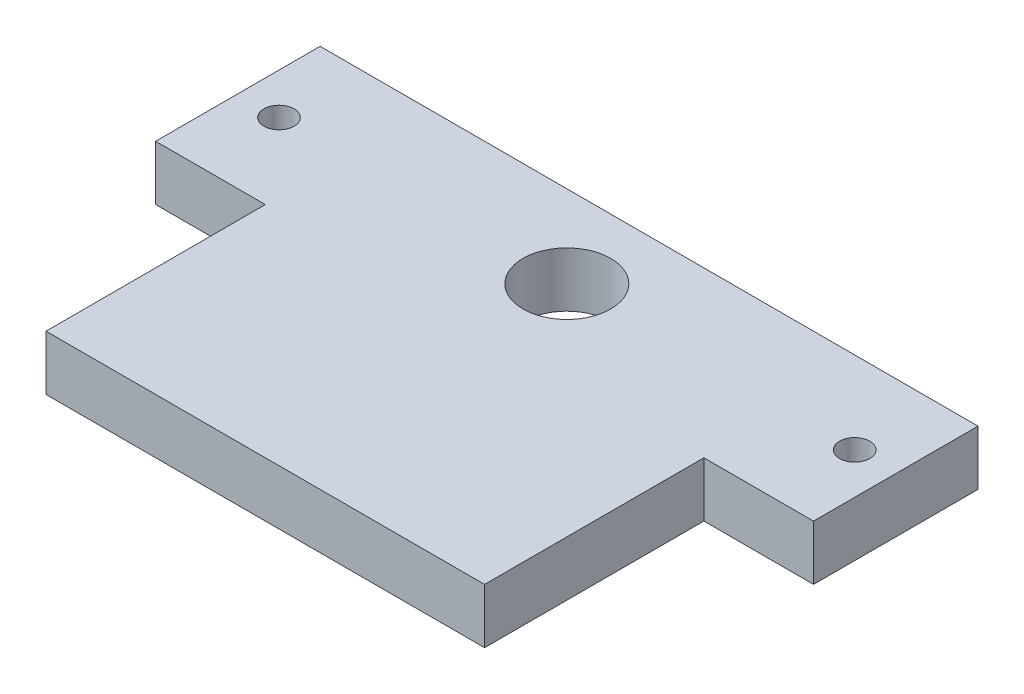
ISO-10303-21;
HEADER;
FILE_DESCRIPTION(('STEP AP214'),'2;1');
FILE_NAME('part.step','',(''),(''),'','','');
FILE_SCHEMA(('AUTOMOTIVE_DESIGN { 1 0 10303 214 1 1 1 1 }'));
ENDSEC;
DATA;
#1=APPLICATION_CONTEXT('core data for automotive mechanical design processes');
#2=APPLICATION_PROTOCOL_DEFINITION('international standard','automotive_design',2000,#1);
#3=PRODUCT_CONTEXT('',#1,'mechanical');
#4=PRODUCT('Part','Part','',(#3));
#5=PRODUCT_RELATED_PRODUCT_CATEGORY('part','',(#4));
#6=PRODUCT_DEFINITION_FORMATION('','',#4);
#7=PRODUCT_DEFINITION_CONTEXT('part definition',#1,'design');
#8=PRODUCT_DEFINITION('design','',#6,#7);
#9=PRODUCT_DEFINITION_SHAPE('','',#8);
#10=(LENGTH_UNIT() NAMED_UNIT(*) SI_UNIT(.MILLI.,.METRE.));
#11=(NAMED_UNIT(*) PLANE_ANGLE_UNIT() SI_UNIT($,.RADIAN.));
#12=(NAMED_UNIT(*) SI_UNIT($,.STERADIAN.) SOLID_ANGLE_UNIT());
#13=UNCERTAINTY_MEASURE_WITH_UNIT(LENGTH_MEASURE(1.E-05),#10,'distance_accuracy_value','');
#14=(GEOMETRIC_REPRESENTATION_CONTEXT(3) GLOBAL_UNCERTAINTY_ASSIGNED_CONTEXT((#13)) GLOBAL_UNIT_ASSIGNED_CONTEXT((#10,
#11,#12)) REPRESENTATION_CONTEXT('',''));
#15=CARTESIAN_POINT('',(0.,0.,0.));
#16=DIRECTION('',(0.,0.,1.));
#17=DIRECTION('',(1.,0.,0.));
#18=AXIS2_PLACEMENT_3D('',#15,#16,#17);
#19=CARTESIAN_POINT('',(-23.8146515722242,-0.508,-2.45370452561246));
#20=DIRECTION('',(0.,0.,1.));
#21=DIRECTION('',(1.,0.,0.));
#22=AXIS2_PLACEMENT_3D('',#19,#20,#21);
#23=PLANE('',#22);
#24=DIRECTION('',(1.,0.,0.));
#25=VECTOR('',#24,1.);
#26=CARTESIAN_POINT('',(-23.8146515722242,-0.508,-2.45370452561246));
#27=LINE('',#26,#25);
#28=CARTESIAN_POINT('',(-23.8146515722242,-0.508,-2.45370452561246));
#29=VERTEX_POINT('',#28);
#30=CARTESIAN_POINT('',(-22.7986515722242,-0.508,-2.45370452561246));
#31=VERTEX_POINT('',#30);
#32=EDGE_CURVE('E158',#29,#31,#27,.T.);
#33=ORIENTED_EDGE('',*,*,#32,.T.);
#34=DIRECTION('',(0.,1.,0.));
#35=VECTOR('',#34,1.);
#36=CARTESIAN_POINT('',(-22.7986515722242,-0.508,-2.45370452561246));
#37=LINE('',#36,#35);
#38=CARTESIAN_POINT('',(-22.7986515722242,0.,-2.45370452561246));
#39=VERTEX_POINT('',#38);
#40=EDGE_CURVE('E127',#31,#39,#37,.T.);
#41=ORIENTED_EDGE('',*,*,#40,.T.);
#42=DIRECTION('',(1.,0.,0.));
#43=VECTOR('',#42,1.);
#44=CARTESIAN_POINT('',(-23.8146515722242,0.,-2.45370452561246));
#45=LINE('',#44,#43);
#46=CARTESIAN_POINT('',(-23.8146515722242,0.,-2.45370452561246));
#47=VERTEX_POINT('',#46);
#48=EDGE_CURVE('E163',#47,#39,#45,.T.);
#49=ORIENTED_EDGE('',*,*,#48,.F.);
#50=DIRECTION('',(0.,1.,0.));
#51=VECTOR('',#50,1.);
#52=CARTESIAN_POINT('',(-23.8146515722242,-0.508,-2.45370452561246));
#53=LINE('',#52,#51);
#54=EDGE_CURVE('E85',#29,#47,#53,.T.);
#55=ORIENTED_EDGE('',*,*,#54,.F.);
#56=EDGE_LOOP('',(#33,#41,#49,#55));
#57=FACE_BOUND('',#56,.T.);
#58=ADVANCED_FACE('F35',(#57),#23,.T.);
#59=CARTESIAN_POINT('',(-23.8146515722242,-0.508,-2.45370452561246));
#60=DIRECTION('',(-1.,0.,0.));
#61=DIRECTION('',(0.,0.,1.));
#62=AXIS2_PLACEMENT_3D('',#59,#60,#61);
#63=PLANE('',#62);
#64=DIRECTION('',(0.,0.,1.));
#65=VECTOR('',#64,1.);
#66=CARTESIAN_POINT('',(-23.8146515722242,0.,-2.45370452561246));
#67=LINE('',#66,#65);
#68=CARTESIAN_POINT('',(-23.8146515722242,0.,-3.97770452561246));
#69=VERTEX_POINT('',#68);
#70=EDGE_CURVE('E164',#69,#47,#67,.T.);
#71=ORIENTED_EDGE('',*,*,#70,.F.);
#72=DIRECTION('',(0.,1.,0.));
#73=VECTOR('',#72,1.);
#74=CARTESIAN_POINT('',(-23.8146515722242,-0.508,-3.97770452561246));
#75=LINE('',#74,#73);
#76=CARTESIAN_POINT('',(-23.8146515722242,-0.508,-3.97770452561246));
#77=VERTEX_POINT('',#76);
#78=EDGE_CURVE('E11',#77,#69,#75,.T.);
#79=ORIENTED_EDGE('',*,*,#78,.F.);
#80=DIRECTION('',(0.,0.,1.));
#81=VECTOR('',#80,1.);
#82=CARTESIAN_POINT('',(-23.8146515722242,-0.508,-2.45370452561246));
#83=LINE('',#82,#81);
#84=EDGE_CURVE('E146',#77,#29,#83,.T.);
#85=ORIENTED_EDGE('',*,*,#84,.T.);
#86=ORIENTED_EDGE('',*,*,#54,.T.);
#87=EDGE_LOOP('',(#71,#79,#85,#86));
#88=FACE_BOUND('',#87,.T.);
#89=ADVANCED_FACE('F37',(#88),#63,.T.);
#90=CARTESIAN_POINT('',(-23.8146515722242,-0.508,-3.97770452561246));
#91=DIRECTION('',(0.,0.,-1.));
#92=DIRECTION('',(-1.,0.,0.));
#93=AXIS2_PLACEMENT_3D('',#90,#91,#92);
#94=PLANE('',#93);
#95=DIRECTION('',(-1.,0.,0.));
#96=VECTOR('',#95,1.);
#97=CARTESIAN_POINT('',(-23.8146515722242,0.,-3.97770452561246));
#98=LINE('',#97,#96);
#99=CARTESIAN_POINT('',(-17.7186515722242,0.,-3.97770452561246));
#100=VERTEX_POINT('',#99);
#101=EDGE_CURVE('E149',#100,#69,#98,.T.);
#102=ORIENTED_EDGE('',*,*,#101,.F.);
#103=DIRECTION('',(0.,1.,0.));
#104=VECTOR('',#103,1.);
#105=CARTESIAN_POINT('',(-17.7186515722242,-0.508,-3.97770452561246));
#106=LINE('',#105,#104);
#107=CARTESIAN_POINT('',(-17.7186515722242,-0.508,-3.97770452561246));
#108=VERTEX_POINT('',#107);
#109=EDGE_CURVE('E44',#108,#100,#106,.T.);
#110=ORIENTED_EDGE('',*,*,#109,.F.);
#111=DIRECTION('',(-1.,0.,0.));
#112=VECTOR('',#111,1.);
#113=CARTESIAN_POINT('',(-23.8146515722242,-0.508,-3.97770452561246));
#114=LINE('',#113,#112);
#115=EDGE_CURVE('E178',#108,#77,#114,.T.);
#116=ORIENTED_EDGE('',*,*,#115,.T.);
#117=ORIENTED_EDGE('',*,*,#78,.T.);
#118=EDGE_LOOP('',(#102,#110,#116,#117));
#119=FACE_BOUND('',#118,.T.);
#120=ADVANCED_FACE('F188',(#119),#94,.T.);
#121=CARTESIAN_POINT('',(-17.7186515722242,-0.508,-2.45370452561246));
#122=DIRECTION('',(1.,0.,0.));
#123=DIRECTION('',(0.,0.,-1.));
#124=AXIS2_PLACEMENT_3D('',#121,#122,#123);
#125=PLANE('',#124);
#126=DIRECTION('',(0.,0.,-1.));
#127=VECTOR('',#126,1.);
#128=CARTESIAN_POINT('',(-17.7186515722242,0.,-2.45370452561246));
#129=LINE('',#128,#127);
#130=CARTESIAN_POINT('',(-17.7186515722242,0.,-2.45370452561246));
#131=VERTEX_POINT('',#130);
#132=EDGE_CURVE('E169',#131,#100,#129,.T.);
#133=ORIENTED_EDGE('',*,*,#132,.F.);
#134=DIRECTION('',(0.,1.,0.));
#135=VECTOR('',#134,1.);
#136=CARTESIAN_POINT('',(-17.7186515722242,-0.508,-2.45370452561246));
#137=LINE('',#136,#135);
#138=CARTESIAN_POINT('',(-17.7186515722242,-0.508,-2.45370452561246));
#139=VERTEX_POINT('',#138);
#140=EDGE_CURVE('E176',#139,#131,#137,.T.);
#141=ORIENTED_EDGE('',*,*,#140,.F.);
#142=DIRECTION('',(0.,0.,-1.));
#143=VECTOR('',#142,1.);
#144=CARTESIAN_POINT('',(-17.7186515722242,-0.508,-2.45370452561246));
#145=LINE('',#144,#143);
#146=EDGE_CURVE('E152',#139,#108,#145,.T.);
#147=ORIENTED_EDGE('',*,*,#146,.T.);
#148=ORIENTED_EDGE('',*,*,#109,.T.);
#149=EDGE_LOOP('',(#133,#141,#147,#148));
#150=FACE_BOUND('',#149,.T.);
#151=ADVANCED_FACE('F185',(#150),#125,.T.);
#152=DIRECTION('',(0.,1.,0.));
#153=VECTOR('',#152,1.);
#154=CARTESIAN_POINT('',(-18.7346515722242,-0.508,-2.45370452561246));
#155=LINE('',#154,#153);
#156=CARTESIAN_POINT('',(-18.7346515722242,-0.508,-2.45370452561246));
#157=VERTEX_POINT('',#156);
#158=CARTESIAN_POINT('',(-18.7346515722242,0.,-2.45370452561246));
#159=VERTEX_POINT('',#158);
#160=EDGE_CURVE('E137',#157,#159,#155,.T.);
#161=ORIENTED_EDGE('',*,*,#160,.F.);
#162=EDGE_CURVE('E148',#157,#139,#27,.T.);
#163=ORIENTED_EDGE('',*,*,#162,.T.);
#164=ORIENTED_EDGE('',*,*,#140,.T.);
#165=EDGE_CURVE('E160',#159,#131,#45,.T.);
#166=ORIENTED_EDGE('',*,*,#165,.F.);
#167=EDGE_LOOP('',(#161,#163,#164,#166));
#168=FACE_BOUND('',#167,.T.);
#169=ADVANCED_FACE('F194',(#168),#23,.T.);
#170=CARTESIAN_POINT('',(0.,-0.508,0.));
#171=DIRECTION('',(0.,-1.,0.));
#172=DIRECTION('',(0.,0.,-1.));
#173=AXIS2_PLACEMENT_3D('',#170,#171,#172);
#174=PLANE('',#173);
#175=CARTESIAN_POINT('',(-18.0996515722242,-0.508,-3.21570452561246));
#176=DIRECTION('',(0.,1.,0.));
#177=DIRECTION('',(0.,0.,1.));
#178=AXIS2_PLACEMENT_3D('',#175,#176,#177);
#179=CIRCLE('',#178,0.139699999999999);
#180=CARTESIAN_POINT('',(-18.0996515722242,-0.508,-3.07600452561246));
#181=VERTEX_POINT('',#180);
#182=EDGE_CURVE('E225',#181,#181,#179,.T.);
#183=ORIENTED_EDGE('',*,*,#182,.T.);
#184=EDGE_LOOP('',(#183));
#185=FACE_BOUND('',#184,.T.);
#186=CARTESIAN_POINT('',(-23.4336515722242,-0.508,-3.21570452561246));
#187=DIRECTION('',(0.,1.,0.));
#188=DIRECTION('',(0.,0.,1.));
#189=AXIS2_PLACEMENT_3D('',#186,#187,#188);
#190=CIRCLE('',#189,0.139699999999999);
#191=CARTESIAN_POINT('',(-23.4336515722242,-0.508,-3.07600452561246));
#192=VERTEX_POINT('',#191);
#193=EDGE_CURVE('E219',#192,#192,#190,.T.);
#194=ORIENTED_EDGE('',*,*,#193,.T.);
#195=EDGE_LOOP('',(#194));
#196=FACE_BOUND('',#195,.T.);
#197=CARTESIAN_POINT('',(-20.7666515722242,-0.508,-3.21570452561246));
#198=DIRECTION('',(0.,1.,0.));
#199=DIRECTION('',(0.,0.,1.));
#200=AXIS2_PLACEMENT_3D('',#197,#198,#199);
#201=CIRCLE('',#200,0.406400000000001);
#202=CARTESIAN_POINT('',(-20.7666515722242,-0.508,-2.80930452561246));
#203=VERTEX_POINT('',#202);
#204=EDGE_CURVE('E214',#203,#203,#201,.T.);
#205=ORIENTED_EDGE('',*,*,#204,.T.);
#206=EDGE_LOOP('',(#205));
#207=FACE_BOUND('',#206,.T.);
#208=ORIENTED_EDGE('',*,*,#84,.F.);
#209=ORIENTED_EDGE('',*,*,#115,.F.);
#210=ORIENTED_EDGE('',*,*,#146,.F.);
#211=ORIENTED_EDGE('',*,*,#162,.F.);
#212=DIRECTION('',(0.,0.,-1.));
#213=VECTOR('',#212,1.);
#214=CARTESIAN_POINT('',(-18.7346515722242,-0.508,-2.45370452561246));
#215=LINE('',#214,#213);
#216=CARTESIAN_POINT('',(-18.7346515722242,-0.508,-0.421704525612461));
#217=VERTEX_POINT('',#216);
#218=EDGE_CURVE('E117',#217,#157,#215,.T.);
#219=ORIENTED_EDGE('',*,*,#218,.F.);
#220=DIRECTION('',(1.,0.,0.));
#221=VECTOR('',#220,1.);
#222=CARTESIAN_POINT('',(-22.7986515722242,-0.508,-0.421704525612461));
#223=LINE('',#222,#221);
#224=CARTESIAN_POINT('',(-22.7986515722242,-0.508,-0.421704525612461));
#225=VERTEX_POINT('',#224);
#226=EDGE_CURVE('E112',#225,#217,#223,.T.);
#227=ORIENTED_EDGE('',*,*,#226,.F.);
#228=DIRECTION('',(0.,0.,1.));
#229=VECTOR('',#228,1.);
#230=CARTESIAN_POINT('',(-22.7986515722242,-0.508,-2.45370452561246));
#231=LINE('',#230,#229);
#232=EDGE_CURVE('E123',#31,#225,#231,.T.);
#233=ORIENTED_EDGE('',*,*,#232,.F.);
#234=ORIENTED_EDGE('',*,*,#32,.F.);
#235=EDGE_LOOP('',(#208,#209,#210,#211,#219,#227,#233,#234));
#236=FACE_BOUND('',#235,.T.);
#237=ADVANCED_FACE('F122',(#185,#196,#207,#236),#174,.T.);
#238=CARTESIAN_POINT('',(0.,0.,0.));
#239=DIRECTION('',(0.,-1.,0.));
#240=DIRECTION('',(0.,0.,-1.));
#241=AXIS2_PLACEMENT_3D('',#238,#239,#240);
#242=PLANE('',#241);
#243=CARTESIAN_POINT('',(-18.0996515722242,0.,-3.21570452561246));
#244=DIRECTION('',(0.,1.,0.));
#245=DIRECTION('',(0.,0.,1.));
#246=AXIS2_PLACEMENT_3D('',#243,#244,#245);
#247=CIRCLE('',#246,0.139699999999999);
#248=CARTESIAN_POINT('',(-18.0996515722242,0.,-3.07600452561246));
#249=VERTEX_POINT('',#248);
#250=EDGE_CURVE('E228',#249,#249,#247,.T.);
#251=ORIENTED_EDGE('',*,*,#250,.F.);
#252=EDGE_LOOP('',(#251));
#253=FACE_BOUND('',#252,.T.);
#254=CARTESIAN_POINT('',(-23.4336515722242,0.,-3.21570452561246));
#255=DIRECTION('',(0.,1.,0.));
#256=DIRECTION('',(0.,0.,1.));
#257=AXIS2_PLACEMENT_3D('',#254,#255,#256);
#258=CIRCLE('',#257,0.139699999999999);
#259=CARTESIAN_POINT('',(-23.4336515722242,0.,-3.07600452561246));
#260=VERTEX_POINT('',#259);
#261=EDGE_CURVE('E222',#260,#260,#258,.T.);
#262=ORIENTED_EDGE('',*,*,#261,.F.);
#263=EDGE_LOOP('',(#262));
#264=FACE_BOUND('',#263,.T.);
#265=CARTESIAN_POINT('',(-20.7666515722242,0.,-3.21570452561246));
#266=DIRECTION('',(0.,1.,0.));
#267=DIRECTION('',(0.,0.,1.));
#268=AXIS2_PLACEMENT_3D('',#265,#266,#267);
#269=CIRCLE('',#268,0.406400000000001);
#270=CARTESIAN_POINT('',(-20.7666515722242,0.,-2.80930452561246));
#271=VERTEX_POINT('',#270);
#272=EDGE_CURVE('E216',#271,#271,#269,.T.);
#273=ORIENTED_EDGE('',*,*,#272,.F.);
#274=EDGE_LOOP('',(#273));
#275=FACE_BOUND('',#274,.T.);
#276=ORIENTED_EDGE('',*,*,#70,.T.);
#277=ORIENTED_EDGE('',*,*,#48,.T.);
#278=DIRECTION('',(0.,0.,1.));
#279=VECTOR('',#278,1.);
#280=CARTESIAN_POINT('',(-22.7986515722242,0.,-2.45370452561246));
#281=LINE('',#280,#279);
#282=CARTESIAN_POINT('',(-22.7986515722242,0.,-0.421704525612461));
#283=VERTEX_POINT('',#282);
#284=EDGE_CURVE('E52',#39,#283,#281,.T.);
#285=ORIENTED_EDGE('',*,*,#284,.T.);
#286=DIRECTION('',(1.,0.,0.));
#287=VECTOR('',#286,1.);
#288=CARTESIAN_POINT('',(-22.7986515722242,0.,-0.421704525612461));
#289=LINE('',#288,#287);
#290=CARTESIAN_POINT('',(-18.7346515722242,0.,-0.421704525612461));
#291=VERTEX_POINT('',#290);
#292=EDGE_CURVE('E114',#283,#291,#289,.T.);
#293=ORIENTED_EDGE('',*,*,#292,.T.);
#294=DIRECTION('',(0.,0.,-1.));
#295=VECTOR('',#294,1.);
#296=CARTESIAN_POINT('',(-18.7346515722242,0.,-2.45370452561246));
#297=LINE('',#296,#295);
#298=EDGE_CURVE('E128',#291,#159,#297,.T.);
#299=ORIENTED_EDGE('',*,*,#298,.T.);
#300=ORIENTED_EDGE('',*,*,#165,.T.);
#301=ORIENTED_EDGE('',*,*,#132,.T.);
#302=ORIENTED_EDGE('',*,*,#101,.T.);
#303=EDGE_LOOP('',(#276,#277,#285,#293,#299,#300,#301,#302));
#304=FACE_BOUND('',#303,.T.);
#305=ADVANCED_FACE('F204',(#253,#264,#275,#304),#242,.F.);
#306=CARTESIAN_POINT('',(-22.7986515722242,-0.508,-2.45370452561246));
#307=DIRECTION('',(-1.,0.,0.));
#308=DIRECTION('',(0.,0.,1.));
#309=AXIS2_PLACEMENT_3D('',#306,#307,#308);
#310=PLANE('',#309);
#311=ORIENTED_EDGE('',*,*,#284,.F.);
#312=ORIENTED_EDGE('',*,*,#40,.F.);
#313=ORIENTED_EDGE('',*,*,#232,.T.);
#314=DIRECTION('',(0.,1.,0.));
#315=VECTOR('',#314,1.);
#316=CARTESIAN_POINT('',(-22.7986515722242,-0.508,-0.421704525612461));
#317=LINE('',#316,#315);
#318=EDGE_CURVE('E109',#225,#283,#317,.T.);
#319=ORIENTED_EDGE('',*,*,#318,.T.);
#320=EDGE_LOOP('',(#311,#312,#313,#319));
#321=FACE_BOUND('',#320,.T.);
#322=ADVANCED_FACE('F126',(#321),#310,.T.);
#323=CARTESIAN_POINT('',(-18.7346515722242,-0.508,-2.45370452561246));
#324=DIRECTION('',(1.,0.,0.));
#325=DIRECTION('',(0.,0.,-1.));
#326=AXIS2_PLACEMENT_3D('',#323,#324,#325);
#327=PLANE('',#326);
#328=ORIENTED_EDGE('',*,*,#298,.F.);
#329=DIRECTION('',(0.,1.,0.));
#330=VECTOR('',#329,1.);
#331=CARTESIAN_POINT('',(-18.7346515722242,-0.508,-0.421704525612461));
#332=LINE('',#331,#330);
#333=EDGE_CURVE('E116',#217,#291,#332,.T.);
#334=ORIENTED_EDGE('',*,*,#333,.F.);
#335=ORIENTED_EDGE('',*,*,#218,.T.);
#336=ORIENTED_EDGE('',*,*,#160,.T.);
#337=EDGE_LOOP('',(#328,#334,#335,#336));
#338=FACE_BOUND('',#337,.T.);
#339=ADVANCED_FACE('F211',(#338),#327,.T.);
#340=CARTESIAN_POINT('',(-22.7986515722242,-0.508,-0.421704525612461));
#341=DIRECTION('',(0.,0.,1.));
#342=DIRECTION('',(1.,0.,0.));
#343=AXIS2_PLACEMENT_3D('',#340,#341,#342);
#344=PLANE('',#343);
#345=ORIENTED_EDGE('',*,*,#292,.F.);
#346=ORIENTED_EDGE('',*,*,#318,.F.);
#347=ORIENTED_EDGE('',*,*,#226,.T.);
#348=ORIENTED_EDGE('',*,*,#333,.T.);
#349=EDGE_LOOP('',(#345,#346,#347,#348));
#350=FACE_BOUND('',#349,.T.);
#351=ADVANCED_FACE('F111',(#350),#344,.T.);
#352=CARTESIAN_POINT('',(-20.7666515722242,-0.508,-3.21570452561246));
#353=DIRECTION('',(0.,1.,0.));
#354=DIRECTION('',(0.,0.,1.));
#355=AXIS2_PLACEMENT_3D('',#352,#353,#354);
#356=CYLINDRICAL_SURFACE('',#355,0.406400000000001);
#357=ORIENTED_EDGE('',*,*,#204,.F.);
#358=EDGE_LOOP('',(#357));
#359=FACE_BOUND('',#358,.T.);
#360=ORIENTED_EDGE('',*,*,#272,.T.);
#361=EDGE_LOOP('',(#360));
#362=FACE_BOUND('',#361,.T.);
#363=ADVANCED_FACE('F249',(#359,#362),#356,.F.);
#364=CARTESIAN_POINT('',(-23.4336515722242,-0.508,-3.21570452561246));
#365=DIRECTION('',(0.,1.,0.));
#366=DIRECTION('',(0.,0.,1.));
#367=AXIS2_PLACEMENT_3D('',#364,#365,#366);
#368=CYLINDRICAL_SURFACE('',#367,0.139699999999999);
#369=ORIENTED_EDGE('',*,*,#193,.F.);
#370=EDGE_LOOP('',(#369));
#371=FACE_BOUND('',#370,.T.);
#372=ORIENTED_EDGE('',*,*,#261,.T.);
#373=EDGE_LOOP('',(#372));
#374=FACE_BOUND('',#373,.T.);
#375=ADVANCED_FACE('F238',(#371,#374),#368,.F.);
#376=CARTESIAN_POINT('',(-18.0996515722242,-0.508,-3.21570452561246));
#377=DIRECTION('',(0.,1.,0.));
#378=DIRECTION('',(0.,0.,1.));
#379=AXIS2_PLACEMENT_3D('',#376,#377,#378);
#380=CYLINDRICAL_SURFACE('',#379,0.139699999999999);
#381=ORIENTED_EDGE('',*,*,#182,.F.);
#382=EDGE_LOOP('',(#381));
#383=FACE_BOUND('',#382,.T.);
#384=ORIENTED_EDGE('',*,*,#250,.T.);
#385=EDGE_LOOP('',(#384));
#386=FACE_BOUND('',#385,.T.);
#387=ADVANCED_FACE('F235',(#383,#386),#380,.F.);
#388=CLOSED_SHELL('',(#58,#89,#120,#151,#169,#237,#305,#322,#339,#351,#363,#375,#387));
#389=MANIFOLD_SOLID_BREP('B2',#388);
#390=ADVANCED_BREP_SHAPE_REPRESENTATION('',(#18,#389),#14);
#391=SHAPE_DEFINITION_REPRESENTATION(#9,#390);
ENDSEC;
END-ISO-10303-21;
